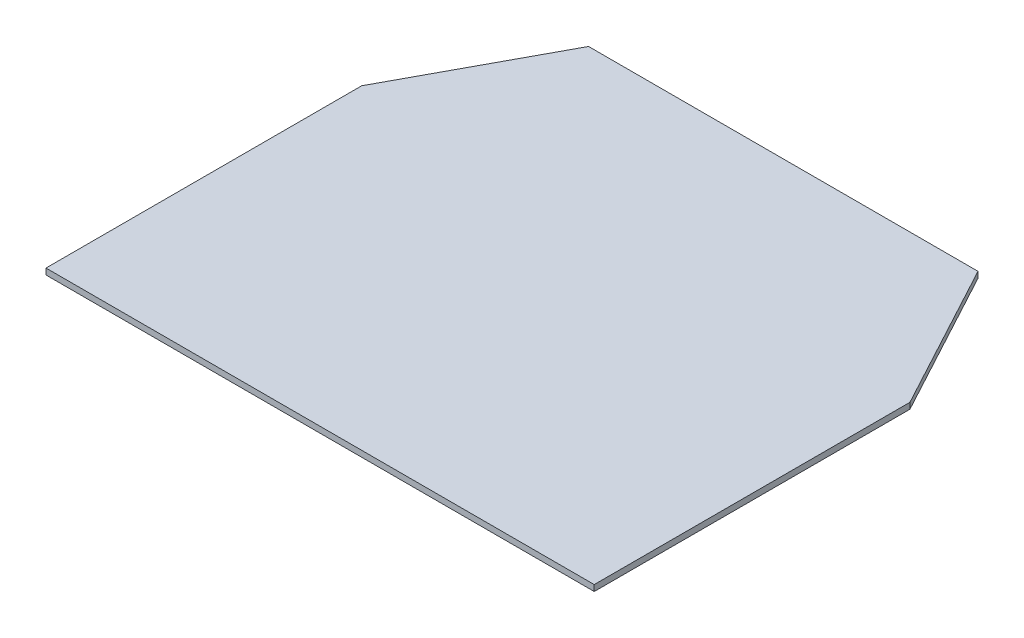
ISO-10303-21;
HEADER;
FILE_DESCRIPTION(('STEP AP214'),'2;1');
FILE_NAME('part.step','',(''),(''),'','','');
FILE_SCHEMA(('AUTOMOTIVE_DESIGN { 1 0 10303 214 1 1 1 1 }'));
ENDSEC;
DATA;
#1=APPLICATION_CONTEXT('core data for automotive mechanical design processes');
#2=APPLICATION_PROTOCOL_DEFINITION('international standard','automotive_design',2000,#1);
#3=PRODUCT_CONTEXT('',#1,'mechanical');
#4=PRODUCT('Part','Part','',(#3));
#5=PRODUCT_RELATED_PRODUCT_CATEGORY('part','',(#4));
#6=PRODUCT_DEFINITION_FORMATION('','',#4);
#7=PRODUCT_DEFINITION_CONTEXT('part definition',#1,'design');
#8=PRODUCT_DEFINITION('design','',#6,#7);
#9=PRODUCT_DEFINITION_SHAPE('','',#8);
#10=(LENGTH_UNIT() NAMED_UNIT(*) SI_UNIT(.MILLI.,.METRE.));
#11=(NAMED_UNIT(*) PLANE_ANGLE_UNIT() SI_UNIT($,.RADIAN.));
#12=(NAMED_UNIT(*) SI_UNIT($,.STERADIAN.) SOLID_ANGLE_UNIT());
#13=UNCERTAINTY_MEASURE_WITH_UNIT(LENGTH_MEASURE(1.E-05),#10,'distance_accuracy_value','');
#14=(GEOMETRIC_REPRESENTATION_CONTEXT(3) GLOBAL_UNCERTAINTY_ASSIGNED_CONTEXT((#13)) GLOBAL_UNIT_ASSIGNED_CONTEXT((#10,
#11,#12)) REPRESENTATION_CONTEXT('',''));
#15=CARTESIAN_POINT('',(0.,0.,0.));
#16=DIRECTION('',(0.,0.,1.));
#17=DIRECTION('',(1.,0.,0.));
#18=AXIS2_PLACEMENT_3D('',#15,#16,#17);
#19=CARTESIAN_POINT('',(290.,3.2,0.));
#20=DIRECTION('',(0.,0.,-1.));
#21=DIRECTION('',(-1.,0.,0.));
#22=AXIS2_PLACEMENT_3D('',#19,#20,#21);
#23=PLANE('',#22);
#24=DIRECTION('',(1.,0.,0.));
#25=VECTOR('',#24,1.);
#26=CARTESIAN_POINT('',(290.,0.,0.));
#27=LINE('',#26,#25);
#28=CARTESIAN_POINT('',(0.,0.,0.));
#29=VERTEX_POINT('',#28);
#30=CARTESIAN_POINT('',(290.,0.,0.));
#31=VERTEX_POINT('',#30);
#32=EDGE_CURVE('E119',#29,#31,#27,.T.);
#33=ORIENTED_EDGE('',*,*,#32,.T.);
#34=DIRECTION('',(0.,-1.,0.));
#35=VECTOR('',#34,1.);
#36=CARTESIAN_POINT('',(290.,3.2,0.));
#37=LINE('',#36,#35);
#38=CARTESIAN_POINT('',(290.,3.2,0.));
#39=VERTEX_POINT('',#38);
#40=EDGE_CURVE('E11',#39,#31,#37,.T.);
#41=ORIENTED_EDGE('',*,*,#40,.F.);
#42=DIRECTION('',(1.,0.,0.));
#43=VECTOR('',#42,1.);
#44=CARTESIAN_POINT('',(290.,3.2,0.));
#45=LINE('',#44,#43);
#46=CARTESIAN_POINT('',(0.,3.2,0.));
#47=VERTEX_POINT('',#46);
#48=EDGE_CURVE('E129',#47,#39,#45,.T.);
#49=ORIENTED_EDGE('',*,*,#48,.F.);
#50=DIRECTION('',(0.,-1.,0.));
#51=VECTOR('',#50,1.);
#52=CARTESIAN_POINT('',(0.,3.2,0.));
#53=LINE('',#52,#51);
#54=EDGE_CURVE('E115',#47,#29,#53,.T.);
#55=ORIENTED_EDGE('',*,*,#54,.T.);
#56=EDGE_LOOP('',(#33,#41,#49,#55));
#57=FACE_BOUND('',#56,.T.);
#58=ADVANCED_FACE('F35',(#57),#23,.F.);
#59=CARTESIAN_POINT('',(290.,3.2,-167.));
#60=DIRECTION('',(-1.,0.,0.));
#61=DIRECTION('',(0.,0.,1.));
#62=AXIS2_PLACEMENT_3D('',#59,#60,#61);
#63=PLANE('',#62);
#64=DIRECTION('',(0.,0.,-1.));
#65=VECTOR('',#64,1.);
#66=CARTESIAN_POINT('',(290.,0.,-167.));
#67=LINE('',#66,#65);
#68=CARTESIAN_POINT('',(290.,0.,-167.));
#69=VERTEX_POINT('',#68);
#70=EDGE_CURVE('E122',#31,#69,#67,.T.);
#71=ORIENTED_EDGE('',*,*,#70,.T.);
#72=DIRECTION('',(0.,-1.,0.));
#73=VECTOR('',#72,1.);
#74=CARTESIAN_POINT('',(290.,3.2,-167.));
#75=LINE('',#74,#73);
#76=CARTESIAN_POINT('',(290.,3.2,-167.));
#77=VERTEX_POINT('',#76);
#78=EDGE_CURVE('E43',#77,#69,#75,.T.);
#79=ORIENTED_EDGE('',*,*,#78,.F.);
#80=DIRECTION('',(0.,0.,-1.));
#81=VECTOR('',#80,1.);
#82=CARTESIAN_POINT('',(290.,3.2,-167.));
#83=LINE('',#82,#81);
#84=EDGE_CURVE('E88',#39,#77,#83,.T.);
#85=ORIENTED_EDGE('',*,*,#84,.F.);
#86=ORIENTED_EDGE('',*,*,#40,.T.);
#87=EDGE_LOOP('',(#71,#79,#85,#86));
#88=FACE_BOUND('',#87,.T.);
#89=ADVANCED_FACE('F153',(#88),#63,.F.);
#90=CARTESIAN_POINT('',(248.,3.2,-245.));
#91=DIRECTION('',(-0.880471099922175,0.,0.474099823035018));
#92=DIRECTION('',(0.474099823035018,0.,0.880471099922175));
#93=AXIS2_PLACEMENT_3D('',#90,#91,#92);
#94=PLANE('',#93);
#95=DIRECTION('',(-0.474099823035018,0.,-0.880471099922175));
#96=VECTOR('',#95,1.);
#97=CARTESIAN_POINT('',(248.,0.,-245.));
#98=LINE('',#97,#96);
#99=CARTESIAN_POINT('',(248.,0.,-245.));
#100=VERTEX_POINT('',#99);
#101=EDGE_CURVE('E124',#69,#100,#98,.T.);
#102=ORIENTED_EDGE('',*,*,#101,.T.);
#103=DIRECTION('',(0.,-1.,0.));
#104=VECTOR('',#103,1.);
#105=CARTESIAN_POINT('',(248.,3.2,-245.));
#106=LINE('',#105,#104);
#107=CARTESIAN_POINT('',(248.,3.2,-245.));
#108=VERTEX_POINT('',#107);
#109=EDGE_CURVE('E110',#108,#100,#106,.T.);
#110=ORIENTED_EDGE('',*,*,#109,.F.);
#111=DIRECTION('',(-0.474099823035018,0.,-0.880471099922175));
#112=VECTOR('',#111,1.);
#113=CARTESIAN_POINT('',(248.,3.2,-245.));
#114=LINE('',#113,#112);
#115=EDGE_CURVE('E101',#77,#108,#114,.T.);
#116=ORIENTED_EDGE('',*,*,#115,.F.);
#117=ORIENTED_EDGE('',*,*,#78,.T.);
#118=EDGE_LOOP('',(#102,#110,#116,#117));
#119=FACE_BOUND('',#118,.T.);
#120=ADVANCED_FACE('F135',(#119),#94,.F.);
#121=CARTESIAN_POINT('',(42.,3.2,-245.));
#122=DIRECTION('',(0.,0.,1.));
#123=DIRECTION('',(1.,0.,0.));
#124=AXIS2_PLACEMENT_3D('',#121,#122,#123);
#125=PLANE('',#124);
#126=DIRECTION('',(-1.,0.,0.));
#127=VECTOR('',#126,1.);
#128=CARTESIAN_POINT('',(42.,0.,-245.));
#129=LINE('',#128,#127);
#130=CARTESIAN_POINT('',(42.,0.,-245.));
#131=VERTEX_POINT('',#130);
#132=EDGE_CURVE('E109',#100,#131,#129,.T.);
#133=ORIENTED_EDGE('',*,*,#132,.T.);
#134=DIRECTION('',(0.,-1.,0.));
#135=VECTOR('',#134,1.);
#136=CARTESIAN_POINT('',(42.,3.2,-245.));
#137=LINE('',#136,#135);
#138=CARTESIAN_POINT('',(42.,3.2,-245.));
#139=VERTEX_POINT('',#138);
#140=EDGE_CURVE('E106',#139,#131,#137,.T.);
#141=ORIENTED_EDGE('',*,*,#140,.F.);
#142=DIRECTION('',(-1.,0.,0.));
#143=VECTOR('',#142,1.);
#144=CARTESIAN_POINT('',(42.,3.2,-245.));
#145=LINE('',#144,#143);
#146=EDGE_CURVE('E95',#108,#139,#145,.T.);
#147=ORIENTED_EDGE('',*,*,#146,.F.);
#148=ORIENTED_EDGE('',*,*,#109,.T.);
#149=EDGE_LOOP('',(#133,#141,#147,#148));
#150=FACE_BOUND('',#149,.T.);
#151=ADVANCED_FACE('F107',(#150),#125,.F.);
#152=CARTESIAN_POINT('',(0.,3.2,-167.));
#153=DIRECTION('',(0.880471099922175,0.,0.474099823035018));
#154=DIRECTION('',(0.474099823035018,0.,-0.880471099922175));
#155=AXIS2_PLACEMENT_3D('',#152,#153,#154);
#156=PLANE('',#155);
#157=DIRECTION('',(-0.474099823035017,0.,0.880471099922175));
#158=VECTOR('',#157,1.);
#159=CARTESIAN_POINT('',(0.,0.,-167.));
#160=LINE('',#159,#158);
#161=CARTESIAN_POINT('',(0.,0.,-167.));
#162=VERTEX_POINT('',#161);
#163=EDGE_CURVE('E74',#131,#162,#160,.T.);
#164=ORIENTED_EDGE('',*,*,#163,.T.);
#165=DIRECTION('',(0.,-1.,0.));
#166=VECTOR('',#165,1.);
#167=CARTESIAN_POINT('',(0.,3.2,-167.));
#168=LINE('',#167,#166);
#169=CARTESIAN_POINT('',(0.,3.2,-167.));
#170=VERTEX_POINT('',#169);
#171=EDGE_CURVE('E111',#170,#162,#168,.T.);
#172=ORIENTED_EDGE('',*,*,#171,.F.);
#173=DIRECTION('',(-0.474099823035017,0.,0.880471099922175));
#174=VECTOR('',#173,1.);
#175=CARTESIAN_POINT('',(0.,3.2,-167.));
#176=LINE('',#175,#174);
#177=EDGE_CURVE('E99',#139,#170,#176,.T.);
#178=ORIENTED_EDGE('',*,*,#177,.F.);
#179=ORIENTED_EDGE('',*,*,#140,.T.);
#180=EDGE_LOOP('',(#164,#172,#178,#179));
#181=FACE_BOUND('',#180,.T.);
#182=ADVANCED_FACE('F113',(#181),#156,.F.);
#183=CARTESIAN_POINT('',(0.,3.2,0.));
#184=DIRECTION('',(1.,0.,0.));
#185=DIRECTION('',(0.,0.,-1.));
#186=AXIS2_PLACEMENT_3D('',#183,#184,#185);
#187=PLANE('',#186);
#188=DIRECTION('',(0.,0.,1.));
#189=VECTOR('',#188,1.);
#190=CARTESIAN_POINT('',(0.,0.,0.));
#191=LINE('',#190,#189);
#192=EDGE_CURVE('E80',#162,#29,#191,.T.);
#193=ORIENTED_EDGE('',*,*,#192,.T.);
#194=ORIENTED_EDGE('',*,*,#54,.F.);
#195=DIRECTION('',(0.,0.,1.));
#196=VECTOR('',#195,1.);
#197=CARTESIAN_POINT('',(0.,3.2,0.));
#198=LINE('',#197,#196);
#199=EDGE_CURVE('E51',#170,#47,#198,.T.);
#200=ORIENTED_EDGE('',*,*,#199,.F.);
#201=ORIENTED_EDGE('',*,*,#171,.T.);
#202=EDGE_LOOP('',(#193,#194,#200,#201));
#203=FACE_BOUND('',#202,.T.);
#204=ADVANCED_FACE('F142',(#203),#187,.F.);
#205=CARTESIAN_POINT('',(0.,3.2,0.));
#206=DIRECTION('',(0.,-1.,0.));
#207=DIRECTION('',(0.,0.,-1.));
#208=AXIS2_PLACEMENT_3D('',#205,#206,#207);
#209=PLANE('',#208);
#210=ORIENTED_EDGE('',*,*,#48,.T.);
#211=ORIENTED_EDGE('',*,*,#84,.T.);
#212=ORIENTED_EDGE('',*,*,#115,.T.);
#213=ORIENTED_EDGE('',*,*,#146,.T.);
#214=ORIENTED_EDGE('',*,*,#177,.T.);
#215=ORIENTED_EDGE('',*,*,#199,.T.);
#216=EDGE_LOOP('',(#210,#211,#212,#213,#214,#215));
#217=FACE_BOUND('',#216,.T.);
#218=ADVANCED_FACE('F97',(#217),#209,.F.);
#219=CARTESIAN_POINT('',(0.,0.,0.));
#220=DIRECTION('',(0.,-1.,0.));
#221=DIRECTION('',(0.,0.,-1.));
#222=AXIS2_PLACEMENT_3D('',#219,#220,#221);
#223=PLANE('',#222);
#224=ORIENTED_EDGE('',*,*,#32,.F.);
#225=ORIENTED_EDGE('',*,*,#192,.F.);
#226=ORIENTED_EDGE('',*,*,#163,.F.);
#227=ORIENTED_EDGE('',*,*,#132,.F.);
#228=ORIENTED_EDGE('',*,*,#101,.F.);
#229=ORIENTED_EDGE('',*,*,#70,.F.);
#230=EDGE_LOOP('',(#224,#225,#226,#227,#228,#229));
#231=FACE_BOUND('',#230,.T.);
#232=ADVANCED_FACE('F138',(#231),#223,.T.);
#233=CLOSED_SHELL('',(#58,#89,#120,#151,#182,#204,#218,#232));
#234=MANIFOLD_SOLID_BREP('B2',#233);
#235=ADVANCED_BREP_SHAPE_REPRESENTATION('',(#18,#234),#14);
#236=SHAPE_DEFINITION_REPRESENTATION(#9,#235);
ENDSEC;
END-ISO-10303-21;
